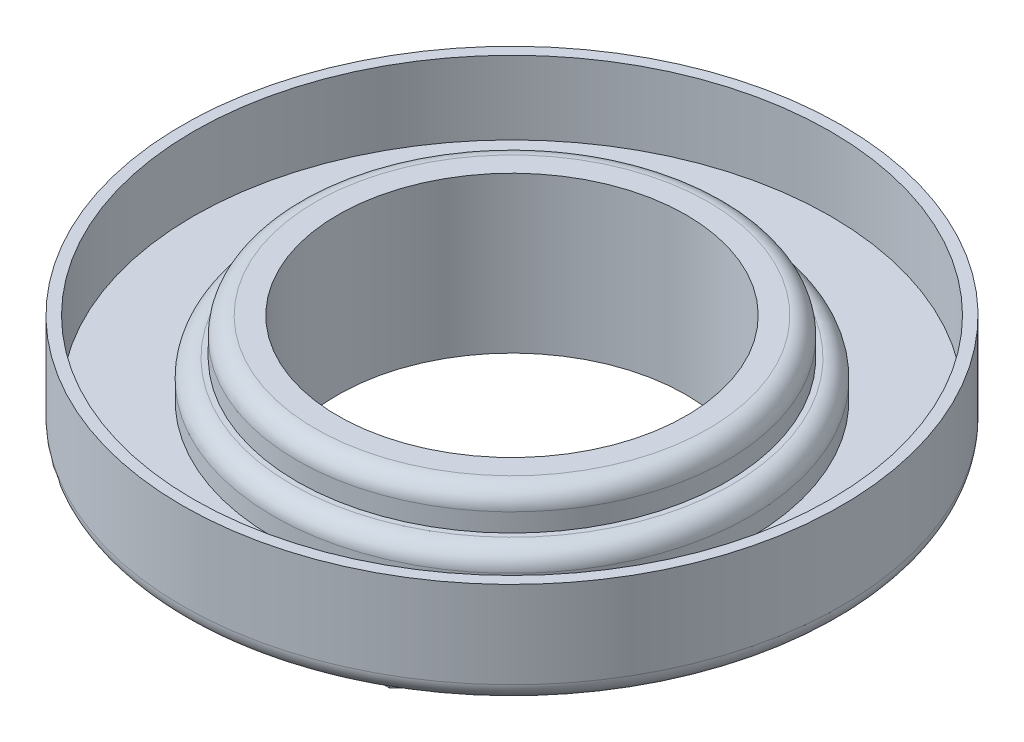
ISO-10303-21;
HEADER;
FILE_DESCRIPTION(('STEP AP214'),'2;1');
FILE_NAME('part.step','',(''),(''),'','','');
FILE_SCHEMA(('AUTOMOTIVE_DESIGN { 1 0 10303 214 1 1 1 1 }'));
ENDSEC;
DATA;
#1=APPLICATION_CONTEXT('core data for automotive mechanical design processes');
#2=APPLICATION_PROTOCOL_DEFINITION('international standard','automotive_design',2000,#1);
#3=PRODUCT_CONTEXT('',#1,'mechanical');
#4=PRODUCT('Part','Part','',(#3));
#5=PRODUCT_RELATED_PRODUCT_CATEGORY('part','',(#4));
#6=PRODUCT_DEFINITION_FORMATION('','',#4);
#7=PRODUCT_DEFINITION_CONTEXT('part definition',#1,'design');
#8=PRODUCT_DEFINITION('design','',#6,#7);
#9=PRODUCT_DEFINITION_SHAPE('','',#8);
#10=(LENGTH_UNIT() NAMED_UNIT(*) SI_UNIT(.MILLI.,.METRE.));
#11=(NAMED_UNIT(*) PLANE_ANGLE_UNIT() SI_UNIT($,.RADIAN.));
#12=(NAMED_UNIT(*) SI_UNIT($,.STERADIAN.) SOLID_ANGLE_UNIT());
#13=UNCERTAINTY_MEASURE_WITH_UNIT(LENGTH_MEASURE(1.E-05),#10,'distance_accuracy_value','');
#14=(GEOMETRIC_REPRESENTATION_CONTEXT(3) GLOBAL_UNCERTAINTY_ASSIGNED_CONTEXT((#13)) GLOBAL_UNIT_ASSIGNED_CONTEXT((#10,
#11,#12)) REPRESENTATION_CONTEXT('',''));
#15=CARTESIAN_POINT('',(0.,0.,0.));
#16=DIRECTION('',(0.,0.,1.));
#17=DIRECTION('',(1.,0.,0.));
#18=AXIS2_PLACEMENT_3D('',#15,#16,#17);
#19=CARTESIAN_POINT('',(0.,5.715,0.));
#20=DIRECTION('',(0.,1.,0.));
#21=DIRECTION('',(0.,0.,1.));
#22=AXIS2_PLACEMENT_3D('',#19,#20,#21);
#23=CYLINDRICAL_SURFACE('',#22,16.51);
#24=CARTESIAN_POINT('',(0.,6.985,0.));
#25=DIRECTION('',(0.,1.,0.));
#26=DIRECTION('',(0.,0.,1.));
#27=AXIS2_PLACEMENT_3D('',#24,#25,#26);
#28=CIRCLE('',#27,16.51);
#29=CARTESIAN_POINT('',(0.,6.985,16.51));
#30=VERTEX_POINT('',#29);
#31=EDGE_CURVE('E142',#30,#30,#28,.F.);
#32=ORIENTED_EDGE('',*,*,#31,.T.);
#33=EDGE_LOOP('',(#32));
#34=FACE_BOUND('',#33,.T.);
#35=CARTESIAN_POINT('',(0.,5.715,0.));
#36=DIRECTION('',(0.,1.,0.));
#37=DIRECTION('',(0.,0.,1.));
#38=AXIS2_PLACEMENT_3D('',#35,#36,#37);
#39=CIRCLE('',#38,16.51);
#40=CARTESIAN_POINT('',(0.,5.715,16.51));
#41=VERTEX_POINT('',#40);
#42=EDGE_CURVE('E240',#41,#41,#39,.T.);
#43=ORIENTED_EDGE('',*,*,#42,.T.);
#44=EDGE_LOOP('',(#43));
#45=FACE_BOUND('',#44,.T.);
#46=ADVANCED_FACE('F37',(#34,#45),#23,.T.);
#47=CARTESIAN_POINT('',(0.,10.795,0.));
#48=DIRECTION('',(0.,-1.,0.));
#49=DIRECTION('',(0.,0.,-1.));
#50=AXIS2_PLACEMENT_3D('',#47,#48,#49);
#51=PLANE('',#50);
#52=CARTESIAN_POINT('',(0.,10.795,0.));
#53=DIRECTION('',(0.,-1.,0.));
#54=DIRECTION('',(0.,0.,-1.));
#55=AXIS2_PLACEMENT_3D('',#52,#53,#54);
#56=CIRCLE('',#55,13.6144);
#57=CARTESIAN_POINT('',(0.,10.795,-13.6144));
#58=VERTEX_POINT('',#57);
#59=EDGE_CURVE('E107',#58,#58,#56,.F.);
#60=ORIENTED_EDGE('',*,*,#59,.T.);
#61=EDGE_LOOP('',(#60));
#62=FACE_BOUND('',#61,.T.);
#63=CARTESIAN_POINT('',(0.,10.795,0.));
#64=DIRECTION('',(0.,-1.,0.));
#65=DIRECTION('',(0.,0.,-1.));
#66=AXIS2_PLACEMENT_3D('',#63,#64,#65);
#67=CIRCLE('',#66,12.065);
#68=CARTESIAN_POINT('',(0.,10.795,-12.065));
#69=VERTEX_POINT('',#68);
#70=EDGE_CURVE('E238',#69,#69,#67,.T.);
#71=ORIENTED_EDGE('',*,*,#70,.T.);
#72=EDGE_LOOP('',(#71));
#73=FACE_BOUND('',#72,.T.);
#74=ADVANCED_FACE('F161',(#62,#73),#51,.F.);
#75=CARTESIAN_POINT('',(-15.8115,10.795,6.35000000000001));
#76=DIRECTION('',(0.745,0.,-0.667064464650907));
#77=DIRECTION('',(-0.667064464650907,0.,-0.745));
#78=AXIS2_PLACEMENT_3D('',#75,#76,#77);
#79=PLANE('',#78);
#80=DIRECTION('',(0.,-1.,0.));
#81=VECTOR('',#80,1.);
#82=CARTESIAN_POINT('',(-7.33978129893349,10.795,15.8115));
#83=LINE('',#82,#81);
#84=CARTESIAN_POINT('',(-7.33978129893349,3.5052,15.8115));
#85=VERTEX_POINT('',#84);
#86=CARTESIAN_POINT('',(-7.33978129893349,0.,15.8115));
#87=VERTEX_POINT('',#86);
#88=EDGE_CURVE('E108',#85,#87,#83,.T.);
#89=ORIENTED_EDGE('',*,*,#88,.F.);
#90=DIRECTION('',(-0.667064464650907,0.,-0.745));
#91=VECTOR('',#90,1.);
#92=CARTESIAN_POINT('',(-15.8115,3.5052,6.35000000000001));
#93=LINE('',#92,#91);
#94=CARTESIAN_POINT('',(-15.8115,3.5052,6.35000000000001));
#95=VERTEX_POINT('',#94);
#96=EDGE_CURVE('E103',#85,#95,#93,.T.);
#97=ORIENTED_EDGE('',*,*,#96,.T.);
#98=DIRECTION('',(0.,-1.,0.));
#99=VECTOR('',#98,1.);
#100=CARTESIAN_POINT('',(-15.8115,10.795,6.35000000000001));
#101=LINE('',#100,#99);
#102=CARTESIAN_POINT('',(-15.8115,0.,6.35000000000001));
#103=VERTEX_POINT('',#102);
#104=EDGE_CURVE('E60',#95,#103,#101,.T.);
#105=ORIENTED_EDGE('',*,*,#104,.T.);
#106=DIRECTION('',(0.667064464650907,0.,0.745));
#107=VECTOR('',#106,1.);
#108=CARTESIAN_POINT('',(-15.8115,0.,6.35000000000001));
#109=LINE('',#108,#107);
#110=EDGE_CURVE('E112',#103,#87,#109,.T.);
#111=ORIENTED_EDGE('',*,*,#110,.T.);
#112=EDGE_LOOP('',(#89,#97,#105,#111));
#113=FACE_BOUND('',#112,.T.);
#114=ADVANCED_FACE('F111',(#113),#79,.F.);
#115=CARTESIAN_POINT('',(7.3397812989335,10.795,15.8115));
#116=DIRECTION('',(0.,0.,-1.));
#117=DIRECTION('',(-1.,0.,0.));
#118=AXIS2_PLACEMENT_3D('',#115,#116,#117);
#119=PLANE('',#118);
#120=DIRECTION('',(0.,-1.,0.));
#121=VECTOR('',#120,1.);
#122=CARTESIAN_POINT('',(7.3397812989335,10.795,15.8115));
#123=LINE('',#122,#121);
#124=CARTESIAN_POINT('',(7.33978129893349,3.5052,15.8115));
#125=VERTEX_POINT('',#124);
#126=CARTESIAN_POINT('',(7.3397812989335,0.,15.8115));
#127=VERTEX_POINT('',#126);
#128=EDGE_CURVE('E134',#125,#127,#123,.T.);
#129=ORIENTED_EDGE('',*,*,#128,.F.);
#130=DIRECTION('',(-1.,0.,0.));
#131=VECTOR('',#130,1.);
#132=CARTESIAN_POINT('',(7.3397812989335,3.5052,15.8115));
#133=LINE('',#132,#131);
#134=EDGE_CURVE('E113',#125,#85,#133,.T.);
#135=ORIENTED_EDGE('',*,*,#134,.T.);
#136=ORIENTED_EDGE('',*,*,#88,.T.);
#137=DIRECTION('',(1.,0.,0.));
#138=VECTOR('',#137,1.);
#139=CARTESIAN_POINT('',(7.3397812989335,0.,15.8115));
#140=LINE('',#139,#138);
#141=EDGE_CURVE('E274',#87,#127,#140,.T.);
#142=ORIENTED_EDGE('',*,*,#141,.T.);
#143=EDGE_LOOP('',(#129,#135,#136,#142));
#144=FACE_BOUND('',#143,.T.);
#145=ADVANCED_FACE('F216',(#144),#119,.F.);
#146=CARTESIAN_POINT('',(15.8115,10.795,6.35));
#147=DIRECTION('',(-0.745,0.,-0.667064464650906));
#148=DIRECTION('',(-0.667064464650906,0.,0.745));
#149=AXIS2_PLACEMENT_3D('',#146,#147,#148);
#150=PLANE('',#149);
#151=DIRECTION('',(0.,-1.,0.));
#152=VECTOR('',#151,1.);
#153=CARTESIAN_POINT('',(15.8115,10.795,6.35));
#154=LINE('',#153,#152);
#155=CARTESIAN_POINT('',(15.8115,3.5052,6.35));
#156=VERTEX_POINT('',#155);
#157=CARTESIAN_POINT('',(15.8115,0.,6.35));
#158=VERTEX_POINT('',#157);
#159=EDGE_CURVE('E132',#156,#158,#154,.T.);
#160=ORIENTED_EDGE('',*,*,#159,.F.);
#161=DIRECTION('',(-0.667064464650906,0.,0.745));
#162=VECTOR('',#161,1.);
#163=CARTESIAN_POINT('',(15.8115,3.5052,6.35));
#164=LINE('',#163,#162);
#165=EDGE_CURVE('E269',#156,#125,#164,.T.);
#166=ORIENTED_EDGE('',*,*,#165,.T.);
#167=ORIENTED_EDGE('',*,*,#128,.T.);
#168=DIRECTION('',(0.667064464650906,0.,-0.745));
#169=VECTOR('',#168,1.);
#170=CARTESIAN_POINT('',(15.8115,0.,6.35));
#171=LINE('',#170,#169);
#172=EDGE_CURVE('E277',#127,#158,#171,.T.);
#173=ORIENTED_EDGE('',*,*,#172,.T.);
#174=EDGE_LOOP('',(#160,#166,#167,#173));
#175=FACE_BOUND('',#174,.T.);
#176=ADVANCED_FACE('F212',(#175),#150,.F.);
#177=CARTESIAN_POINT('',(15.8115,10.795,-6.35));
#178=DIRECTION('',(-1.,0.,0.));
#179=DIRECTION('',(0.,0.,1.));
#180=AXIS2_PLACEMENT_3D('',#177,#178,#179);
#181=PLANE('',#180);
#182=DIRECTION('',(0.,-1.,0.));
#183=VECTOR('',#182,1.);
#184=CARTESIAN_POINT('',(15.8115,10.795,-6.35));
#185=LINE('',#184,#183);
#186=CARTESIAN_POINT('',(15.8115,3.5052,-6.35));
#187=VERTEX_POINT('',#186);
#188=CARTESIAN_POINT('',(15.8115,0.,-6.35));
#189=VERTEX_POINT('',#188);
#190=EDGE_CURVE('E130',#187,#189,#185,.T.);
#191=ORIENTED_EDGE('',*,*,#190,.F.);
#192=DIRECTION('',(0.,0.,1.));
#193=VECTOR('',#192,1.);
#194=CARTESIAN_POINT('',(15.8115,3.5052,-6.35));
#195=LINE('',#194,#193);
#196=EDGE_CURVE('E266',#187,#156,#195,.T.);
#197=ORIENTED_EDGE('',*,*,#196,.T.);
#198=ORIENTED_EDGE('',*,*,#159,.T.);
#199=DIRECTION('',(0.,0.,-1.));
#200=VECTOR('',#199,1.);
#201=CARTESIAN_POINT('',(15.8115,0.,-6.35));
#202=LINE('',#201,#200);
#203=EDGE_CURVE('E280',#158,#189,#202,.T.);
#204=ORIENTED_EDGE('',*,*,#203,.T.);
#205=EDGE_LOOP('',(#191,#197,#198,#204));
#206=FACE_BOUND('',#205,.T.);
#207=ADVANCED_FACE('F208',(#206),#181,.F.);
#208=CARTESIAN_POINT('',(7.3397812989335,10.795,-15.8115));
#209=DIRECTION('',(-0.745,0.,0.667064464650906));
#210=DIRECTION('',(0.667064464650906,0.,0.745));
#211=AXIS2_PLACEMENT_3D('',#208,#209,#210);
#212=PLANE('',#211);
#213=DIRECTION('',(0.,-1.,0.));
#214=VECTOR('',#213,1.);
#215=CARTESIAN_POINT('',(7.3397812989335,10.795,-15.8115));
#216=LINE('',#215,#214);
#217=CARTESIAN_POINT('',(7.3397812989335,3.5052,-15.8115));
#218=VERTEX_POINT('',#217);
#219=CARTESIAN_POINT('',(7.3397812989335,0.,-15.8115));
#220=VERTEX_POINT('',#219);
#221=EDGE_CURVE('E128',#218,#220,#216,.T.);
#222=ORIENTED_EDGE('',*,*,#221,.F.);
#223=DIRECTION('',(0.667064464650906,0.,0.745));
#224=VECTOR('',#223,1.);
#225=CARTESIAN_POINT('',(7.3397812989335,3.5052,-15.8115));
#226=LINE('',#225,#224);
#227=EDGE_CURVE('E263',#218,#187,#226,.T.);
#228=ORIENTED_EDGE('',*,*,#227,.T.);
#229=ORIENTED_EDGE('',*,*,#190,.T.);
#230=DIRECTION('',(-0.667064464650906,0.,-0.745));
#231=VECTOR('',#230,1.);
#232=CARTESIAN_POINT('',(7.3397812989335,0.,-15.8115));
#233=LINE('',#232,#231);
#234=EDGE_CURVE('E283',#189,#220,#233,.T.);
#235=ORIENTED_EDGE('',*,*,#234,.T.);
#236=EDGE_LOOP('',(#222,#228,#229,#235));
#237=FACE_BOUND('',#236,.T.);
#238=ADVANCED_FACE('F204',(#237),#212,.F.);
#239=CARTESIAN_POINT('',(-7.33978129893351,10.795,-15.8115));
#240=DIRECTION('',(0.,0.,1.));
#241=DIRECTION('',(1.,0.,0.));
#242=AXIS2_PLACEMENT_3D('',#239,#240,#241);
#243=PLANE('',#242);
#244=DIRECTION('',(0.,-1.,0.));
#245=VECTOR('',#244,1.);
#246=CARTESIAN_POINT('',(-7.33978129893351,10.795,-15.8115));
#247=LINE('',#246,#245);
#248=CARTESIAN_POINT('',(-7.33978129893351,3.5052,-15.8115));
#249=VERTEX_POINT('',#248);
#250=CARTESIAN_POINT('',(-7.33978129893351,0.,-15.8115));
#251=VERTEX_POINT('',#250);
#252=EDGE_CURVE('E121',#249,#251,#247,.T.);
#253=ORIENTED_EDGE('',*,*,#252,.F.);
#254=DIRECTION('',(1.,0.,0.));
#255=VECTOR('',#254,1.);
#256=CARTESIAN_POINT('',(-7.33978129893351,3.5052,-15.8115));
#257=LINE('',#256,#255);
#258=EDGE_CURVE('E260',#249,#218,#257,.T.);
#259=ORIENTED_EDGE('',*,*,#258,.T.);
#260=ORIENTED_EDGE('',*,*,#221,.T.);
#261=DIRECTION('',(-1.,0.,0.));
#262=VECTOR('',#261,1.);
#263=CARTESIAN_POINT('',(-7.33978129893351,0.,-15.8115));
#264=LINE('',#263,#262);
#265=EDGE_CURVE('E286',#220,#251,#264,.T.);
#266=ORIENTED_EDGE('',*,*,#265,.T.);
#267=EDGE_LOOP('',(#253,#259,#260,#266));
#268=FACE_BOUND('',#267,.T.);
#269=ADVANCED_FACE('F200',(#268),#243,.F.);
#270=CARTESIAN_POINT('',(-7.33978129893351,10.795,-15.8115));
#271=DIRECTION('',(0.745000000000001,0.,0.667064464650905));
#272=DIRECTION('',(0.667064464650905,0.,-0.745000000000001));
#273=AXIS2_PLACEMENT_3D('',#270,#271,#272);
#274=PLANE('',#273);
#275=DIRECTION('',(0.,-1.,0.));
#276=VECTOR('',#275,1.);
#277=CARTESIAN_POINT('',(-15.8115,10.795,-6.34999999999999));
#278=LINE('',#277,#276);
#279=CARTESIAN_POINT('',(-15.8115,3.5052,-6.34999999999999));
#280=VERTEX_POINT('',#279);
#281=CARTESIAN_POINT('',(-15.8115,0.,-6.34999999999999));
#282=VERTEX_POINT('',#281);
#283=EDGE_CURVE('E119',#280,#282,#278,.T.);
#284=ORIENTED_EDGE('',*,*,#283,.F.);
#285=DIRECTION('',(0.667064464650905,0.,-0.745000000000001));
#286=VECTOR('',#285,1.);
#287=CARTESIAN_POINT('',(-7.33978129893351,3.5052,-15.8115));
#288=LINE('',#287,#286);
#289=EDGE_CURVE('E52',#280,#249,#288,.T.);
#290=ORIENTED_EDGE('',*,*,#289,.T.);
#291=ORIENTED_EDGE('',*,*,#252,.T.);
#292=DIRECTION('',(-0.667064464650905,0.,0.745000000000001));
#293=VECTOR('',#292,1.);
#294=CARTESIAN_POINT('',(-7.33978129893351,0.,-15.8115));
#295=LINE('',#294,#293);
#296=EDGE_CURVE('E123',#251,#282,#295,.T.);
#297=ORIENTED_EDGE('',*,*,#296,.T.);
#298=EDGE_LOOP('',(#284,#290,#291,#297));
#299=FACE_BOUND('',#298,.T.);
#300=ADVANCED_FACE('F197',(#299),#274,.F.);
#301=CARTESIAN_POINT('',(-15.8115,10.795,-6.34999999999999));
#302=DIRECTION('',(1.,0.,0.));
#303=DIRECTION('',(0.,0.,-1.));
#304=AXIS2_PLACEMENT_3D('',#301,#302,#303);
#305=PLANE('',#304);
#306=ORIENTED_EDGE('',*,*,#104,.F.);
#307=DIRECTION('',(0.,0.,-1.));
#308=VECTOR('',#307,1.);
#309=CARTESIAN_POINT('',(-15.8115,3.5052,-6.34999999999999));
#310=LINE('',#309,#308);
#311=EDGE_CURVE('E101',#95,#280,#310,.T.);
#312=ORIENTED_EDGE('',*,*,#311,.T.);
#313=ORIENTED_EDGE('',*,*,#283,.T.);
#314=DIRECTION('',(0.,0.,1.));
#315=VECTOR('',#314,1.);
#316=CARTESIAN_POINT('',(-15.8115,0.,-6.34999999999999));
#317=LINE('',#316,#315);
#318=EDGE_CURVE('E117',#282,#103,#317,.T.);
#319=ORIENTED_EDGE('',*,*,#318,.T.);
#320=EDGE_LOOP('',(#306,#312,#313,#319));
#321=FACE_BOUND('',#320,.T.);
#322=ADVANCED_FACE('F115',(#321),#305,.F.);
#323=CARTESIAN_POINT('',(0.,0.,0.));
#324=DIRECTION('',(0.,-1.,0.));
#325=DIRECTION('',(0.,0.,-1.));
#326=AXIS2_PLACEMENT_3D('',#323,#324,#325);
#327=PLANE('',#326);
#328=CARTESIAN_POINT('',(0.,0.,0.));
#329=DIRECTION('',(0.,-1.,0.));
#330=DIRECTION('',(0.,0.,-1.));
#331=AXIS2_PLACEMENT_3D('',#328,#329,#330);
#332=CIRCLE('',#331,12.065);
#333=CARTESIAN_POINT('',(0.,0.,-12.065));
#334=VERTEX_POINT('',#333);
#335=EDGE_CURVE('E241',#334,#334,#332,.T.);
#336=ORIENTED_EDGE('',*,*,#335,.F.);
#337=EDGE_LOOP('',(#336));
#338=FACE_BOUND('',#337,.T.);
#339=ORIENTED_EDGE('',*,*,#110,.F.);
#340=ORIENTED_EDGE('',*,*,#318,.F.);
#341=ORIENTED_EDGE('',*,*,#296,.F.);
#342=ORIENTED_EDGE('',*,*,#265,.F.);
#343=ORIENTED_EDGE('',*,*,#234,.F.);
#344=ORIENTED_EDGE('',*,*,#203,.F.);
#345=ORIENTED_EDGE('',*,*,#172,.F.);
#346=ORIENTED_EDGE('',*,*,#141,.F.);
#347=EDGE_LOOP('',(#339,#340,#341,#342,#343,#344,#345,#346));
#348=FACE_BOUND('',#347,.T.);
#349=ADVANCED_FACE('F186',(#338,#348),#327,.T.);
#350=CARTESIAN_POINT('',(0.,3.5052,0.));
#351=DIRECTION('',(0.,-1.,0.));
#352=DIRECTION('',(0.,0.,-1.));
#353=AXIS2_PLACEMENT_3D('',#350,#351,#352);
#354=PLANE('',#353);
#355=CARTESIAN_POINT('',(0.,3.5052,0.));
#356=DIRECTION('',(0.,-1.,0.));
#357=DIRECTION('',(0.,0.,-1.));
#358=AXIS2_PLACEMENT_3D('',#355,#356,#357);
#359=CIRCLE('',#358,21.5646);
#360=CARTESIAN_POINT('',(0.,3.5052,-21.5646));
#361=VERTEX_POINT('',#360);
#362=EDGE_CURVE('E45',#361,#361,#359,.T.);
#363=ORIENTED_EDGE('',*,*,#362,.T.);
#364=EDGE_LOOP('',(#363));
#365=FACE_BOUND('',#364,.T.);
#366=ORIENTED_EDGE('',*,*,#96,.F.);
#367=ORIENTED_EDGE('',*,*,#134,.F.);
#368=ORIENTED_EDGE('',*,*,#165,.F.);
#369=ORIENTED_EDGE('',*,*,#196,.F.);
#370=ORIENTED_EDGE('',*,*,#227,.F.);
#371=ORIENTED_EDGE('',*,*,#258,.F.);
#372=ORIENTED_EDGE('',*,*,#289,.F.);
#373=ORIENTED_EDGE('',*,*,#311,.F.);
#374=EDGE_LOOP('',(#366,#367,#368,#369,#370,#371,#372,#373));
#375=FACE_BOUND('',#374,.T.);
#376=ADVANCED_FACE('F102',(#365,#375),#354,.T.);
#377=CARTESIAN_POINT('',(0.,10.795,0.));
#378=DIRECTION('',(0.,-1.,0.));
#379=DIRECTION('',(0.,0.,-1.));
#380=AXIS2_PLACEMENT_3D('',#377,#378,#379);
#381=CYLINDRICAL_SURFACE('',#380,22.8346);
#382=CARTESIAN_POINT('',(0.,4.7752,0.));
#383=DIRECTION('',(0.,-1.,0.));
#384=DIRECTION('',(0.,0.,-1.));
#385=AXIS2_PLACEMENT_3D('',#382,#383,#384);
#386=CIRCLE('',#385,22.8346);
#387=CARTESIAN_POINT('',(0.,4.7752,-22.8346));
#388=VERTEX_POINT('',#387);
#389=EDGE_CURVE('E11',#388,#388,#386,.F.);
#390=ORIENTED_EDGE('',*,*,#389,.T.);
#391=EDGE_LOOP('',(#390));
#392=FACE_BOUND('',#391,.T.);
#393=CARTESIAN_POINT('',(0.,10.795,0.));
#394=DIRECTION('',(0.,-1.,0.));
#395=DIRECTION('',(0.,0.,-1.));
#396=AXIS2_PLACEMENT_3D('',#393,#394,#395);
#397=CIRCLE('',#396,22.8346);
#398=CARTESIAN_POINT('',(0.,10.795,-22.8346));
#399=VERTEX_POINT('',#398);
#400=EDGE_CURVE('E254',#399,#399,#397,.T.);
#401=ORIENTED_EDGE('',*,*,#400,.T.);
#402=EDGE_LOOP('',(#401));
#403=FACE_BOUND('',#402,.T.);
#404=ADVANCED_FACE('F185',(#392,#403),#381,.T.);
#405=CARTESIAN_POINT('',(0.,10.795,0.));
#406=DIRECTION('',(0.,1.,0.));
#407=DIRECTION('',(0.,0.,1.));
#408=AXIS2_PLACEMENT_3D('',#405,#406,#407);
#409=CIRCLE('',#408,22.0726);
#410=CARTESIAN_POINT('',(0.,10.795,22.0726));
#411=VERTEX_POINT('',#410);
#412=EDGE_CURVE('E244',#411,#411,#409,.T.);
#413=ORIENTED_EDGE('',*,*,#412,.F.);
#414=EDGE_LOOP('',(#413));
#415=FACE_BOUND('',#414,.T.);
#416=ORIENTED_EDGE('',*,*,#400,.F.);
#417=EDGE_LOOP('',(#416));
#418=FACE_BOUND('',#417,.T.);
#419=ADVANCED_FACE('F169',(#415,#418),#51,.F.);
#420=CARTESIAN_POINT('',(0.,5.715,0.));
#421=DIRECTION('',(0.,1.,0.));
#422=DIRECTION('',(0.,0.,1.));
#423=AXIS2_PLACEMENT_3D('',#420,#421,#422);
#424=CYLINDRICAL_SURFACE('',#423,22.0726);
#425=CARTESIAN_POINT('',(0.,5.715,0.));
#426=DIRECTION('',(0.,1.,0.));
#427=DIRECTION('',(0.,0.,1.));
#428=AXIS2_PLACEMENT_3D('',#425,#426,#427);
#429=CIRCLE('',#428,22.0726);
#430=CARTESIAN_POINT('',(0.,5.715,22.0726));
#431=VERTEX_POINT('',#430);
#432=EDGE_CURVE('E251',#431,#431,#429,.T.);
#433=ORIENTED_EDGE('',*,*,#432,.F.);
#434=EDGE_LOOP('',(#433));
#435=FACE_BOUND('',#434,.T.);
#436=ORIENTED_EDGE('',*,*,#412,.T.);
#437=EDGE_LOOP('',(#436));
#438=FACE_BOUND('',#437,.T.);
#439=ADVANCED_FACE('F178',(#435,#438),#424,.F.);
#440=CARTESIAN_POINT('',(0.,5.715,0.));
#441=DIRECTION('',(0.,1.,0.));
#442=DIRECTION('',(0.,0.,1.));
#443=AXIS2_PLACEMENT_3D('',#440,#441,#442);
#444=PLANE('',#443);
#445=ORIENTED_EDGE('',*,*,#42,.F.);
#446=EDGE_LOOP('',(#445));
#447=FACE_BOUND('',#446,.T.);
#448=ORIENTED_EDGE('',*,*,#432,.T.);
#449=EDGE_LOOP('',(#448));
#450=FACE_BOUND('',#449,.T.);
#451=ADVANCED_FACE('F175',(#447,#450),#444,.T.);
#452=CARTESIAN_POINT('',(0.,10.795,0.));
#453=DIRECTION('',(0.,-1.,0.));
#454=DIRECTION('',(0.,0.,-1.));
#455=AXIS2_PLACEMENT_3D('',#452,#453,#454);
#456=CYLINDRICAL_SURFACE('',#455,12.065);
#457=ORIENTED_EDGE('',*,*,#70,.F.);
#458=EDGE_LOOP('',(#457));
#459=FACE_BOUND('',#458,.T.);
#460=ORIENTED_EDGE('',*,*,#335,.T.);
#461=EDGE_LOOP('',(#460));
#462=FACE_BOUND('',#461,.T.);
#463=ADVANCED_FACE('F173',(#459,#462),#456,.F.);
#464=CARTESIAN_POINT('',(0.,8.255,0.));
#465=DIRECTION('',(0.,1.,0.));
#466=DIRECTION('',(0.,0.,1.));
#467=AXIS2_PLACEMENT_3D('',#464,#465,#466);
#468=PLANE('',#467);
#469=CARTESIAN_POINT('',(0.,8.255,0.));
#470=DIRECTION('',(0.,1.,0.));
#471=DIRECTION('',(0.,0.,1.));
#472=AXIS2_PLACEMENT_3D('',#469,#470,#471);
#473=CIRCLE('',#472,15.24);
#474=CARTESIAN_POINT('',(0.,8.255,15.24));
#475=VERTEX_POINT('',#474);
#476=EDGE_CURVE('E145',#475,#475,#473,.T.);
#477=ORIENTED_EDGE('',*,*,#476,.T.);
#478=EDGE_LOOP('',(#477));
#479=FACE_BOUND('',#478,.T.);
#480=CARTESIAN_POINT('',(0.,8.255,0.));
#481=DIRECTION('',(0.,1.,0.));
#482=DIRECTION('',(0.,0.,1.));
#483=AXIS2_PLACEMENT_3D('',#480,#481,#482);
#484=CIRCLE('',#483,14.8844);
#485=CARTESIAN_POINT('',(0.,8.255,14.8844));
#486=VERTEX_POINT('',#485);
#487=EDGE_CURVE('E247',#486,#486,#484,.T.);
#488=ORIENTED_EDGE('',*,*,#487,.F.);
#489=EDGE_LOOP('',(#488));
#490=FACE_BOUND('',#489,.T.);
#491=ADVANCED_FACE('F229',(#479,#490),#468,.T.);
#492=CARTESIAN_POINT('',(0.,8.255,0.));
#493=DIRECTION('',(0.,1.,0.));
#494=DIRECTION('',(0.,0.,1.));
#495=AXIS2_PLACEMENT_3D('',#492,#493,#494);
#496=CYLINDRICAL_SURFACE('',#495,14.8844);
#497=CARTESIAN_POINT('',(0.,9.525,0.));
#498=DIRECTION('',(0.,-1.,0.));
#499=DIRECTION('',(0.,0.,-1.));
#500=AXIS2_PLACEMENT_3D('',#497,#498,#499);
#501=CIRCLE('',#500,14.8844);
#502=CARTESIAN_POINT('',(0.,9.525,-14.8844));
#503=VERTEX_POINT('',#502);
#504=EDGE_CURVE('E139',#503,#503,#501,.T.);
#505=ORIENTED_EDGE('',*,*,#504,.T.);
#506=EDGE_LOOP('',(#505));
#507=FACE_BOUND('',#506,.T.);
#508=ORIENTED_EDGE('',*,*,#487,.T.);
#509=EDGE_LOOP('',(#508));
#510=FACE_BOUND('',#509,.T.);
#511=ADVANCED_FACE('F224',(#507,#510),#496,.T.);
#512=CARTESIAN_POINT('',(0.,9.525,0.));
#513=DIRECTION('',(0.,-1.,0.));
#514=DIRECTION('',(0.,0.,-1.));
#515=AXIS2_PLACEMENT_3D('',#512,#513,#514);
#516=TOROIDAL_SURFACE('',#515,13.6144,1.27);
#517=ORIENTED_EDGE('',*,*,#504,.F.);
#518=EDGE_LOOP('',(#517));
#519=FACE_BOUND('',#518,.T.);
#520=ORIENTED_EDGE('',*,*,#59,.F.);
#521=EDGE_LOOP('',(#520));
#522=FACE_BOUND('',#521,.T.);
#523=ADVANCED_FACE('F157',(#519,#522),#516,.T.);
#524=CARTESIAN_POINT('',(0.,6.985,0.));
#525=DIRECTION('',(0.,1.,0.));
#526=DIRECTION('',(0.,0.,1.));
#527=AXIS2_PLACEMENT_3D('',#524,#525,#526);
#528=TOROIDAL_SURFACE('',#527,15.24,1.27);
#529=ORIENTED_EDGE('',*,*,#476,.F.);
#530=EDGE_LOOP('',(#529));
#531=FACE_BOUND('',#530,.T.);
#532=ORIENTED_EDGE('',*,*,#31,.F.);
#533=EDGE_LOOP('',(#532));
#534=FACE_BOUND('',#533,.T.);
#535=ADVANCED_FACE('F152',(#531,#534),#528,.T.);
#536=CARTESIAN_POINT('',(0.,4.7752,0.));
#537=DIRECTION('',(0.,-1.,0.));
#538=DIRECTION('',(0.,0.,-1.));
#539=AXIS2_PLACEMENT_3D('',#536,#537,#538);
#540=TOROIDAL_SURFACE('',#539,21.5646,1.27);
#541=ORIENTED_EDGE('',*,*,#389,.F.);
#542=EDGE_LOOP('',(#541));
#543=FACE_BOUND('',#542,.T.);
#544=ORIENTED_EDGE('',*,*,#362,.F.);
#545=EDGE_LOOP('',(#544));
#546=FACE_BOUND('',#545,.T.);
#547=ADVANCED_FACE('F39',(#543,#546),#540,.T.);
#548=CLOSED_SHELL('',(#46,#74,#114,#145,#176,#207,#238,#269,#300,#322,#349,#376,#404,#419,#439,
#451,#463,#491,#511,#523,#535,#547));
#549=MANIFOLD_SOLID_BREP('B2',#548);
#550=ADVANCED_BREP_SHAPE_REPRESENTATION('',(#18,#549),#14);
#551=SHAPE_DEFINITION_REPRESENTATION(#9,#550);
ENDSEC;
END-ISO-10303-21;
